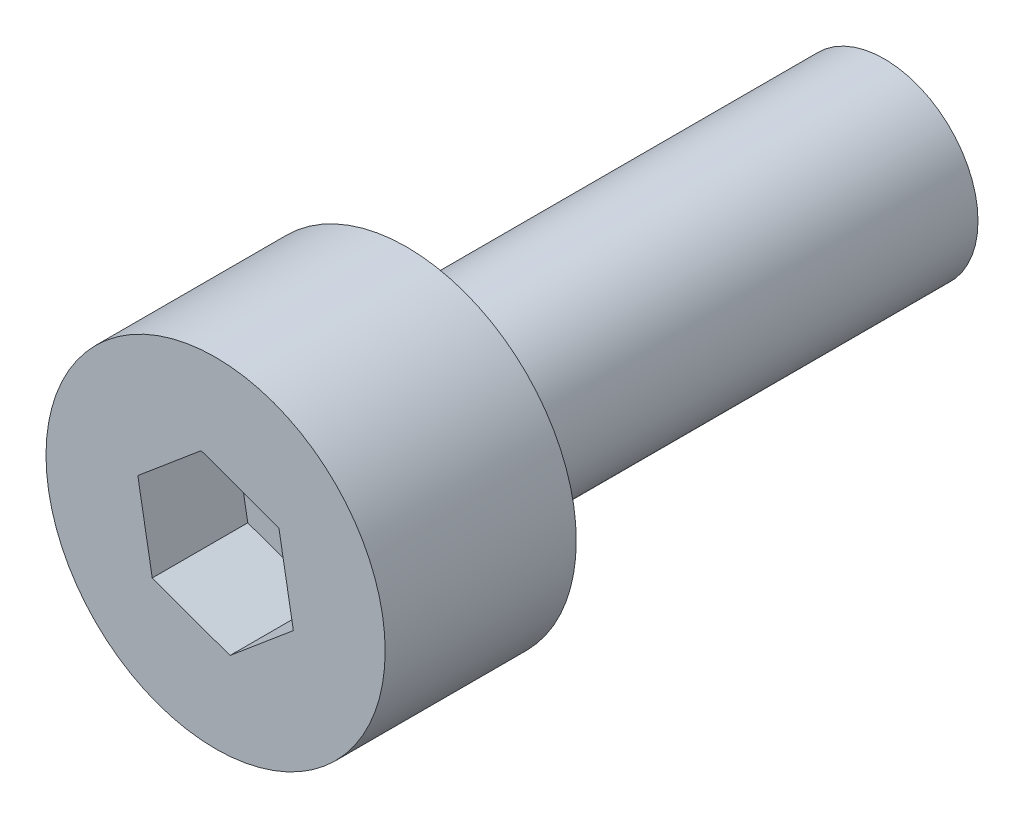
ISO-10303-21;
HEADER;
FILE_DESCRIPTION(('STEP AP214'),'2;1');
FILE_NAME('part.step','',(''),(''),'','','');
FILE_SCHEMA(('AUTOMOTIVE_DESIGN { 1 0 10303 214 1 1 1 1 }'));
ENDSEC;
DATA;
#1=APPLICATION_CONTEXT('core data for automotive mechanical design processes');
#2=APPLICATION_PROTOCOL_DEFINITION('international standard','automotive_design',2000,#1);
#3=PRODUCT_CONTEXT('',#1,'mechanical');
#4=PRODUCT('Part','Part','',(#3));
#5=PRODUCT_RELATED_PRODUCT_CATEGORY('part','',(#4));
#6=PRODUCT_DEFINITION_FORMATION('','',#4);
#7=PRODUCT_DEFINITION_CONTEXT('part definition',#1,'design');
#8=PRODUCT_DEFINITION('design','',#6,#7);
#9=PRODUCT_DEFINITION_SHAPE('','',#8);
#10=(LENGTH_UNIT() NAMED_UNIT(*) SI_UNIT(.MILLI.,.METRE.));
#11=(NAMED_UNIT(*) PLANE_ANGLE_UNIT() SI_UNIT($,.RADIAN.));
#12=(NAMED_UNIT(*) SI_UNIT($,.STERADIAN.) SOLID_ANGLE_UNIT());
#13=UNCERTAINTY_MEASURE_WITH_UNIT(LENGTH_MEASURE(1.E-05),#10,'distance_accuracy_value','');
#14=(GEOMETRIC_REPRESENTATION_CONTEXT(3) GLOBAL_UNCERTAINTY_ASSIGNED_CONTEXT((#13)) GLOBAL_UNIT_ASSIGNED_CONTEXT((#10,
#11,#12)) REPRESENTATION_CONTEXT('',''));
#15=CARTESIAN_POINT('',(0.,0.,0.));
#16=DIRECTION('',(0.,0.,1.));
#17=DIRECTION('',(1.,0.,0.));
#18=AXIS2_PLACEMENT_3D('',#15,#16,#17);
#19=CARTESIAN_POINT('',(0.,0.,10.));
#20=DIRECTION('',(0.,0.,-1.));
#21=DIRECTION('',(-1.,0.,0.));
#22=AXIS2_PLACEMENT_3D('',#19,#20,#21);
#23=CYLINDRICAL_SURFACE('',#22,1.96);
#24=CARTESIAN_POINT('',(0.,0.,10.));
#25=DIRECTION('',(0.,0.,1.));
#26=DIRECTION('',(1.,0.,0.));
#27=AXIS2_PLACEMENT_3D('',#24,#25,#26);
#28=CIRCLE('',#27,1.96);
#29=CARTESIAN_POINT('',(1.96,0.,10.));
#30=VERTEX_POINT('',#29);
#31=EDGE_CURVE('E11',#30,#30,#28,.T.);
#32=ORIENTED_EDGE('',*,*,#31,.F.);
#33=EDGE_LOOP('',(#32));
#34=FACE_BOUND('',#33,.T.);
#35=CARTESIAN_POINT('',(0.,0.,0.));
#36=DIRECTION('',(0.,0.,1.));
#37=DIRECTION('',(1.,0.,0.));
#38=AXIS2_PLACEMENT_3D('',#35,#36,#37);
#39=CIRCLE('',#38,1.96);
#40=CARTESIAN_POINT('',(1.96,0.,0.));
#41=VERTEX_POINT('',#40);
#42=EDGE_CURVE('E36',#41,#41,#39,.T.);
#43=ORIENTED_EDGE('',*,*,#42,.T.);
#44=EDGE_LOOP('',(#43));
#45=FACE_BOUND('',#44,.T.);
#46=ADVANCED_FACE('F33',(#34,#45),#23,.T.);
#47=CARTESIAN_POINT('',(0.,0.,0.));
#48=DIRECTION('',(0.,0.,1.));
#49=DIRECTION('',(1.,0.,0.));
#50=AXIS2_PLACEMENT_3D('',#47,#48,#49);
#51=PLANE('',#50);
#52=ORIENTED_EDGE('',*,*,#42,.F.);
#53=EDGE_LOOP('',(#52));
#54=FACE_BOUND('',#53,.T.);
#55=ADVANCED_FACE('F151',(#54),#51,.F.);
#56=CARTESIAN_POINT('',(0.,0.,10.));
#57=DIRECTION('',(0.,0.,1.));
#58=DIRECTION('',(1.,0.,0.));
#59=AXIS2_PLACEMENT_3D('',#56,#57,#58);
#60=PLANE('',#59);
#61=CARTESIAN_POINT('',(0.,0.,10.));
#62=DIRECTION('',(0.,0.,1.));
#63=DIRECTION('',(1.,0.,0.));
#64=AXIS2_PLACEMENT_3D('',#61,#62,#63);
#65=CIRCLE('',#64,3.55);
#66=CARTESIAN_POINT('',(3.55,0.,10.));
#67=VERTEX_POINT('',#66);
#68=EDGE_CURVE('E134',#67,#67,#65,.T.);
#69=ORIENTED_EDGE('',*,*,#68,.F.);
#70=EDGE_LOOP('',(#69));
#71=FACE_BOUND('',#70,.T.);
#72=ORIENTED_EDGE('',*,*,#31,.T.);
#73=EDGE_LOOP('',(#72));
#74=FACE_BOUND('',#73,.T.);
#75=ADVANCED_FACE('F148',(#71,#74),#60,.F.);
#76=CARTESIAN_POINT('',(0.,0.,14.));
#77=DIRECTION('',(0.,0.,-1.));
#78=DIRECTION('',(-1.,0.,0.));
#79=AXIS2_PLACEMENT_3D('',#76,#77,#78);
#80=CYLINDRICAL_SURFACE('',#79,3.55);
#81=CARTESIAN_POINT('',(0.,0.,14.));
#82=DIRECTION('',(0.,0.,1.));
#83=DIRECTION('',(1.,0.,0.));
#84=AXIS2_PLACEMENT_3D('',#81,#82,#83);
#85=CIRCLE('',#84,3.55);
#86=CARTESIAN_POINT('',(3.55,0.,14.));
#87=VERTEX_POINT('',#86);
#88=EDGE_CURVE('E140',#87,#87,#85,.T.);
#89=ORIENTED_EDGE('',*,*,#88,.F.);
#90=EDGE_LOOP('',(#89));
#91=FACE_BOUND('',#90,.T.);
#92=ORIENTED_EDGE('',*,*,#68,.T.);
#93=EDGE_LOOP('',(#92));
#94=FACE_BOUND('',#93,.T.);
#95=ADVANCED_FACE('F146',(#91,#94),#80,.T.);
#96=CARTESIAN_POINT('',(0.,0.,14.));
#97=DIRECTION('',(0.,0.,1.));
#98=DIRECTION('',(1.,0.,0.));
#99=AXIS2_PLACEMENT_3D('',#96,#97,#98);
#100=PLANE('',#99);
#101=DIRECTION('',(-0.174536153569573,0.984650766057254,0.));
#102=VECTOR('',#101,1.);
#103=CARTESIAN_POINT('',(1.62812889195595,-0.590928346907031,14.));
#104=LINE('',#103,#102);
#105=CARTESIAN_POINT('',(1.62812889195595,-0.590928346907031,14.));
#106=VERTEX_POINT('',#105);
#107=CARTESIAN_POINT('',(1.32582340621581,1.11453680761575,14.));
#108=VERTEX_POINT('',#107);
#109=EDGE_CURVE('E47',#106,#108,#104,.T.);
#110=ORIENTED_EDGE('',*,*,#109,.F.);
#111=DIRECTION('',(0.765464500476604,0.6434781258987,0.));
#112=VECTOR('',#111,1.);
#113=CARTESIAN_POINT('',(0.302305485740145,-1.70546515452278,14.));
#114=LINE('',#113,#112);
#115=CARTESIAN_POINT('',(0.302305485740145,-1.70546515452278,14.));
#116=VERTEX_POINT('',#115);
#117=EDGE_CURVE('E130',#116,#106,#114,.T.);
#118=ORIENTED_EDGE('',*,*,#117,.F.);
#119=DIRECTION('',(0.940000654046177,-0.341172640158555,0.));
#120=VECTOR('',#119,1.);
#121=CARTESIAN_POINT('',(-1.32582340621581,-1.11453680761575,14.));
#122=LINE('',#121,#120);
#123=CARTESIAN_POINT('',(-1.32582340621581,-1.11453680761575,14.));
#124=VERTEX_POINT('',#123);
#125=EDGE_CURVE('E128',#124,#116,#122,.T.);
#126=ORIENTED_EDGE('',*,*,#125,.F.);
#127=DIRECTION('',(0.174536153569573,-0.984650766057255,0.));
#128=VECTOR('',#127,1.);
#129=CARTESIAN_POINT('',(-1.62812889195595,0.59092834690703,14.));
#130=LINE('',#129,#128);
#131=CARTESIAN_POINT('',(-1.62812889195595,0.59092834690703,14.));
#132=VERTEX_POINT('',#131);
#133=EDGE_CURVE('E95',#132,#124,#130,.T.);
#134=ORIENTED_EDGE('',*,*,#133,.F.);
#135=DIRECTION('',(-0.765464500476604,-0.6434781258987,0.));
#136=VECTOR('',#135,1.);
#137=CARTESIAN_POINT('',(-0.302305485740145,1.70546515452278,14.));
#138=LINE('',#137,#136);
#139=CARTESIAN_POINT('',(-0.302305485740145,1.70546515452278,14.));
#140=VERTEX_POINT('',#139);
#141=EDGE_CURVE('E124',#140,#132,#138,.T.);
#142=ORIENTED_EDGE('',*,*,#141,.F.);
#143=DIRECTION('',(-0.940000654046177,0.341172640158555,0.));
#144=VECTOR('',#143,1.);
#145=CARTESIAN_POINT('',(1.32582340621581,1.11453680761575,14.));
#146=LINE('',#145,#144);
#147=EDGE_CURVE('E121',#108,#140,#146,.T.);
#148=ORIENTED_EDGE('',*,*,#147,.F.);
#149=EDGE_LOOP('',(#110,#118,#126,#134,#142,#148));
#150=FACE_BOUND('',#149,.T.);
#151=ORIENTED_EDGE('',*,*,#88,.T.);
#152=EDGE_LOOP('',(#151));
#153=FACE_BOUND('',#152,.T.);
#154=ADVANCED_FACE('F165',(#150,#153),#100,.T.);
#155=CARTESIAN_POINT('',(1.62812889195595,-0.590928346907031,12.));
#156=DIRECTION('',(0.984650766057255,0.174536153569573,0.));
#157=DIRECTION('',(-0.174536153569573,0.984650766057255,0.));
#158=AXIS2_PLACEMENT_3D('',#155,#156,#157);
#159=PLANE('',#158);
#160=ORIENTED_EDGE('',*,*,#109,.T.);
#161=DIRECTION('',(0.,0.,1.));
#162=VECTOR('',#161,1.);
#163=CARTESIAN_POINT('',(1.32582340621581,1.11453680761575,12.));
#164=LINE('',#163,#162);
#165=CARTESIAN_POINT('',(1.32582340621581,1.11453680761575,12.));
#166=VERTEX_POINT('',#165);
#167=EDGE_CURVE('E77',#166,#108,#164,.T.);
#168=ORIENTED_EDGE('',*,*,#167,.F.);
#169=DIRECTION('',(-0.174536153569573,0.984650766057254,0.));
#170=VECTOR('',#169,1.);
#171=CARTESIAN_POINT('',(1.62812889195595,-0.590928346907031,12.));
#172=LINE('',#171,#170);
#173=CARTESIAN_POINT('',(1.62812889195595,-0.590928346907031,12.));
#174=VERTEX_POINT('',#173);
#175=EDGE_CURVE('E132',#174,#166,#172,.T.);
#176=ORIENTED_EDGE('',*,*,#175,.F.);
#177=DIRECTION('',(0.,0.,1.));
#178=VECTOR('',#177,1.);
#179=CARTESIAN_POINT('',(1.62812889195595,-0.590928346907031,12.));
#180=LINE('',#179,#178);
#181=EDGE_CURVE('E55',#174,#106,#180,.T.);
#182=ORIENTED_EDGE('',*,*,#181,.T.);
#183=EDGE_LOOP('',(#160,#168,#176,#182));
#184=FACE_BOUND('',#183,.T.);
#185=ADVANCED_FACE('F170',(#184),#159,.F.);
#186=CARTESIAN_POINT('',(0.302305485740145,-1.70546515452278,12.));
#187=DIRECTION('',(0.6434781258987,-0.765464500476604,0.));
#188=DIRECTION('',(0.765464500476604,0.6434781258987,0.));
#189=AXIS2_PLACEMENT_3D('',#186,#187,#188);
#190=PLANE('',#189);
#191=ORIENTED_EDGE('',*,*,#117,.T.);
#192=ORIENTED_EDGE('',*,*,#181,.F.);
#193=DIRECTION('',(0.765464500476604,0.6434781258987,0.));
#194=VECTOR('',#193,1.);
#195=CARTESIAN_POINT('',(0.302305485740145,-1.70546515452278,12.));
#196=LINE('',#195,#194);
#197=CARTESIAN_POINT('',(0.302305485740145,-1.70546515452278,12.));
#198=VERTEX_POINT('',#197);
#199=EDGE_CURVE('E107',#198,#174,#196,.T.);
#200=ORIENTED_EDGE('',*,*,#199,.F.);
#201=DIRECTION('',(0.,0.,1.));
#202=VECTOR('',#201,1.);
#203=CARTESIAN_POINT('',(0.302305485740145,-1.70546515452278,12.));
#204=LINE('',#203,#202);
#205=EDGE_CURVE('E99',#198,#116,#204,.T.);
#206=ORIENTED_EDGE('',*,*,#205,.T.);
#207=EDGE_LOOP('',(#191,#192,#200,#206));
#208=FACE_BOUND('',#207,.T.);
#209=ADVANCED_FACE('F174',(#208),#190,.F.);
#210=CARTESIAN_POINT('',(-1.32582340621581,-1.11453680761575,12.));
#211=DIRECTION('',(-0.341172640158555,-0.940000654046177,0.));
#212=DIRECTION('',(0.940000654046177,-0.341172640158555,0.));
#213=AXIS2_PLACEMENT_3D('',#210,#211,#212);
#214=PLANE('',#213);
#215=ORIENTED_EDGE('',*,*,#125,.T.);
#216=ORIENTED_EDGE('',*,*,#205,.F.);
#217=DIRECTION('',(0.940000654046177,-0.341172640158555,0.));
#218=VECTOR('',#217,1.);
#219=CARTESIAN_POINT('',(-1.32582340621581,-1.11453680761575,12.));
#220=LINE('',#219,#218);
#221=CARTESIAN_POINT('',(-1.32582340621581,-1.11453680761575,12.));
#222=VERTEX_POINT('',#221);
#223=EDGE_CURVE('E103',#222,#198,#220,.T.);
#224=ORIENTED_EDGE('',*,*,#223,.F.);
#225=DIRECTION('',(0.,0.,1.));
#226=VECTOR('',#225,1.);
#227=CARTESIAN_POINT('',(-1.32582340621581,-1.11453680761575,12.));
#228=LINE('',#227,#226);
#229=EDGE_CURVE('E88',#222,#124,#228,.T.);
#230=ORIENTED_EDGE('',*,*,#229,.T.);
#231=EDGE_LOOP('',(#215,#216,#224,#230));
#232=FACE_BOUND('',#231,.T.);
#233=ADVANCED_FACE('F104',(#232),#214,.F.);
#234=CARTESIAN_POINT('',(-1.62812889195595,0.59092834690703,12.));
#235=DIRECTION('',(-0.984650766057255,-0.174536153569573,0.));
#236=DIRECTION('',(0.174536153569573,-0.984650766057255,0.));
#237=AXIS2_PLACEMENT_3D('',#234,#235,#236);
#238=PLANE('',#237);
#239=ORIENTED_EDGE('',*,*,#133,.T.);
#240=ORIENTED_EDGE('',*,*,#229,.F.);
#241=DIRECTION('',(0.174536153569573,-0.984650766057255,0.));
#242=VECTOR('',#241,1.);
#243=CARTESIAN_POINT('',(-1.62812889195595,0.59092834690703,12.));
#244=LINE('',#243,#242);
#245=CARTESIAN_POINT('',(-1.62812889195595,0.59092834690703,12.));
#246=VERTEX_POINT('',#245);
#247=EDGE_CURVE('E92',#246,#222,#244,.T.);
#248=ORIENTED_EDGE('',*,*,#247,.F.);
#249=DIRECTION('',(0.,0.,1.));
#250=VECTOR('',#249,1.);
#251=CARTESIAN_POINT('',(-1.62812889195595,0.59092834690703,12.));
#252=LINE('',#251,#250);
#253=EDGE_CURVE('E100',#246,#132,#252,.T.);
#254=ORIENTED_EDGE('',*,*,#253,.T.);
#255=EDGE_LOOP('',(#239,#240,#248,#254));
#256=FACE_BOUND('',#255,.T.);
#257=ADVANCED_FACE('F90',(#256),#238,.F.);
#258=CARTESIAN_POINT('',(-0.302305485740145,1.70546515452278,12.));
#259=DIRECTION('',(-0.6434781258987,0.765464500476604,0.));
#260=DIRECTION('',(-0.765464500476604,-0.6434781258987,0.));
#261=AXIS2_PLACEMENT_3D('',#258,#259,#260);
#262=PLANE('',#261);
#263=ORIENTED_EDGE('',*,*,#141,.T.);
#264=ORIENTED_EDGE('',*,*,#253,.F.);
#265=DIRECTION('',(-0.765464500476604,-0.6434781258987,0.));
#266=VECTOR('',#265,1.);
#267=CARTESIAN_POINT('',(-0.302305485740145,1.70546515452278,12.));
#268=LINE('',#267,#266);
#269=CARTESIAN_POINT('',(-0.302305485740145,1.70546515452278,12.));
#270=VERTEX_POINT('',#269);
#271=EDGE_CURVE('E113',#270,#246,#268,.T.);
#272=ORIENTED_EDGE('',*,*,#271,.F.);
#273=DIRECTION('',(0.,0.,1.));
#274=VECTOR('',#273,1.);
#275=CARTESIAN_POINT('',(-0.302305485740145,1.70546515452278,12.));
#276=LINE('',#275,#274);
#277=EDGE_CURVE('E137',#270,#140,#276,.T.);
#278=ORIENTED_EDGE('',*,*,#277,.T.);
#279=EDGE_LOOP('',(#263,#264,#272,#278));
#280=FACE_BOUND('',#279,.T.);
#281=ADVANCED_FACE('F178',(#280),#262,.F.);
#282=CARTESIAN_POINT('',(1.32582340621581,1.11453680761575,12.));
#283=DIRECTION('',(0.341172640158555,0.940000654046177,0.));
#284=DIRECTION('',(-0.940000654046177,0.341172640158555,0.));
#285=AXIS2_PLACEMENT_3D('',#282,#283,#284);
#286=PLANE('',#285);
#287=ORIENTED_EDGE('',*,*,#147,.T.);
#288=ORIENTED_EDGE('',*,*,#277,.F.);
#289=DIRECTION('',(-0.940000654046177,0.341172640158555,0.));
#290=VECTOR('',#289,1.);
#291=CARTESIAN_POINT('',(1.32582340621581,1.11453680761575,12.));
#292=LINE('',#291,#290);
#293=EDGE_CURVE('E115',#166,#270,#292,.T.);
#294=ORIENTED_EDGE('',*,*,#293,.F.);
#295=ORIENTED_EDGE('',*,*,#167,.T.);
#296=EDGE_LOOP('',(#287,#288,#294,#295));
#297=FACE_BOUND('',#296,.T.);
#298=ADVANCED_FACE('F175',(#297),#286,.F.);
#299=CARTESIAN_POINT('',(1.32582340621581,1.11453680761575,12.));
#300=DIRECTION('',(0.,0.,1.));
#301=DIRECTION('',(1.,0.,0.));
#302=AXIS2_PLACEMENT_3D('',#299,#300,#301);
#303=PLANE('',#302);
#304=ORIENTED_EDGE('',*,*,#175,.T.);
#305=ORIENTED_EDGE('',*,*,#293,.T.);
#306=ORIENTED_EDGE('',*,*,#271,.T.);
#307=ORIENTED_EDGE('',*,*,#247,.T.);
#308=ORIENTED_EDGE('',*,*,#223,.T.);
#309=ORIENTED_EDGE('',*,*,#199,.T.);
#310=EDGE_LOOP('',(#304,#305,#306,#307,#308,#309));
#311=FACE_BOUND('',#310,.T.);
#312=ADVANCED_FACE('F110',(#311),#303,.T.);
#313=CLOSED_SHELL('',(#46,#55,#75,#95,#154,#185,#209,#233,#257,#281,#298,#312));
#314=MANIFOLD_SOLID_BREP('B2',#313);
#315=ADVANCED_BREP_SHAPE_REPRESENTATION('',(#18,#314),#14);
#316=SHAPE_DEFINITION_REPRESENTATION(#9,#315);
ENDSEC;
END-ISO-10303-21;
